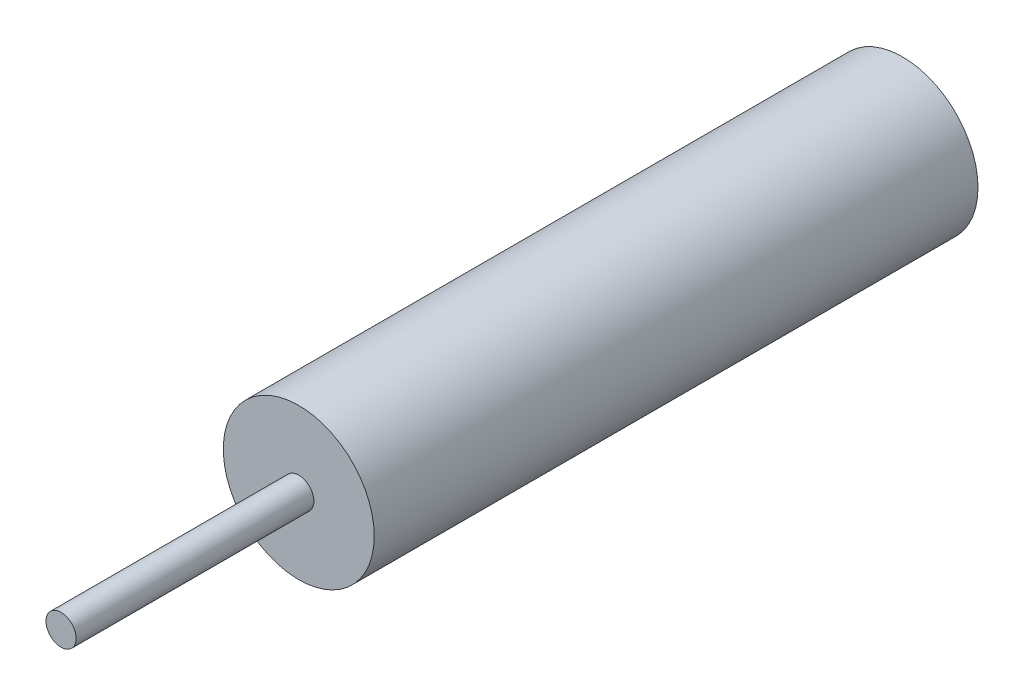
ISO-10303-21;
HEADER;
FILE_DESCRIPTION(('STEP AP214'),'2;1');
FILE_NAME('part.step','',(''),(''),'','','');
FILE_SCHEMA(('AUTOMOTIVE_DESIGN { 1 0 10303 214 1 1 1 1 }'));
ENDSEC;
DATA;
#1=APPLICATION_CONTEXT('core data for automotive mechanical design processes');
#2=APPLICATION_PROTOCOL_DEFINITION('international standard','automotive_design',2000,#1);
#3=PRODUCT_CONTEXT('',#1,'mechanical');
#4=PRODUCT('Part','Part','',(#3));
#5=PRODUCT_RELATED_PRODUCT_CATEGORY('part','',(#4));
#6=PRODUCT_DEFINITION_FORMATION('','',#4);
#7=PRODUCT_DEFINITION_CONTEXT('part definition',#1,'design');
#8=PRODUCT_DEFINITION('design','',#6,#7);
#9=PRODUCT_DEFINITION_SHAPE('','',#8);
#10=(LENGTH_UNIT() NAMED_UNIT(*) SI_UNIT(.MILLI.,.METRE.));
#11=(NAMED_UNIT(*) PLANE_ANGLE_UNIT() SI_UNIT($,.RADIAN.));
#12=(NAMED_UNIT(*) SI_UNIT($,.STERADIAN.) SOLID_ANGLE_UNIT());
#13=UNCERTAINTY_MEASURE_WITH_UNIT(LENGTH_MEASURE(1.E-05),#10,'distance_accuracy_value','');
#14=(GEOMETRIC_REPRESENTATION_CONTEXT(3) GLOBAL_UNCERTAINTY_ASSIGNED_CONTEXT((#13)) GLOBAL_UNIT_ASSIGNED_CONTEXT((#10,
#11,#12)) REPRESENTATION_CONTEXT('',''));
#15=CARTESIAN_POINT('',(0.,0.,0.));
#16=DIRECTION('',(0.,0.,1.));
#17=DIRECTION('',(1.,0.,0.));
#18=AXIS2_PLACEMENT_3D('',#15,#16,#17);
#19=CARTESIAN_POINT('',(0.,0.,25.4));
#20=DIRECTION('',(0.,0.,-1.));
#21=DIRECTION('',(-1.,0.,0.));
#22=AXIS2_PLACEMENT_3D('',#19,#20,#21);
#23=CYLINDRICAL_SURFACE('',#22,3.175);
#24=CARTESIAN_POINT('',(0.,0.,25.4));
#25=DIRECTION('',(0.,0.,1.));
#26=DIRECTION('',(1.,0.,0.));
#27=AXIS2_PLACEMENT_3D('',#24,#25,#26);
#28=CIRCLE('',#27,3.175);
#29=CARTESIAN_POINT('',(3.175,0.,25.4));
#30=VERTEX_POINT('',#29);
#31=EDGE_CURVE('E10',#30,#30,#28,.T.);
#32=ORIENTED_EDGE('',*,*,#31,.F.);
#33=EDGE_LOOP('',(#32));
#34=FACE_BOUND('',#33,.T.);
#35=CARTESIAN_POINT('',(0.,0.,0.));
#36=DIRECTION('',(0.,0.,1.));
#37=DIRECTION('',(1.,0.,0.));
#38=AXIS2_PLACEMENT_3D('',#35,#36,#37);
#39=CIRCLE('',#38,3.175);
#40=CARTESIAN_POINT('',(3.175,0.,0.));
#41=VERTEX_POINT('',#40);
#42=EDGE_CURVE('E34',#41,#41,#39,.T.);
#43=ORIENTED_EDGE('',*,*,#42,.T.);
#44=EDGE_LOOP('',(#43));
#45=FACE_BOUND('',#44,.T.);
#46=ADVANCED_FACE('F31',(#34,#45),#23,.T.);
#47=CARTESIAN_POINT('',(0.,0.,25.4));
#48=DIRECTION('',(0.,0.,1.));
#49=DIRECTION('',(1.,0.,0.));
#50=AXIS2_PLACEMENT_3D('',#47,#48,#49);
#51=PLANE('',#50);
#52=CARTESIAN_POINT('',(0.,0.,25.4));
#53=DIRECTION('',(0.,0.,1.));
#54=DIRECTION('',(1.,0.,0.));
#55=AXIS2_PLACEMENT_3D('',#52,#53,#54);
#56=CIRCLE('',#55,0.635);
#57=CARTESIAN_POINT('',(0.635,0.,25.4));
#58=VERTEX_POINT('',#57);
#59=EDGE_CURVE('E43',#58,#58,#56,.T.);
#60=ORIENTED_EDGE('',*,*,#59,.F.);
#61=EDGE_LOOP('',(#60));
#62=FACE_BOUND('',#61,.T.);
#63=ORIENTED_EDGE('',*,*,#31,.T.);
#64=EDGE_LOOP('',(#63));
#65=FACE_BOUND('',#64,.T.);
#66=ADVANCED_FACE('F58',(#62,#65),#51,.T.);
#67=CARTESIAN_POINT('',(0.,0.,0.));
#68=DIRECTION('',(0.,0.,1.));
#69=DIRECTION('',(1.,0.,0.));
#70=AXIS2_PLACEMENT_3D('',#67,#68,#69);
#71=PLANE('',#70);
#72=ORIENTED_EDGE('',*,*,#42,.F.);
#73=EDGE_LOOP('',(#72));
#74=FACE_BOUND('',#73,.T.);
#75=ADVANCED_FACE('F54',(#74),#71,.F.);
#76=CARTESIAN_POINT('',(0.,0.,35.4));
#77=DIRECTION('',(0.,0.,-1.));
#78=DIRECTION('',(-1.,0.,0.));
#79=AXIS2_PLACEMENT_3D('',#76,#77,#78);
#80=CYLINDRICAL_SURFACE('',#79,0.635);
#81=CARTESIAN_POINT('',(0.,0.,35.4));
#82=DIRECTION('',(0.,0.,1.));
#83=DIRECTION('',(1.,0.,0.));
#84=AXIS2_PLACEMENT_3D('',#81,#82,#83);
#85=CIRCLE('',#84,0.635);
#86=CARTESIAN_POINT('',(0.635,0.,35.4));
#87=VERTEX_POINT('',#86);
#88=EDGE_CURVE('E41',#87,#87,#85,.T.);
#89=ORIENTED_EDGE('',*,*,#88,.F.);
#90=EDGE_LOOP('',(#89));
#91=FACE_BOUND('',#90,.T.);
#92=ORIENTED_EDGE('',*,*,#59,.T.);
#93=EDGE_LOOP('',(#92));
#94=FACE_BOUND('',#93,.T.);
#95=ADVANCED_FACE('F51',(#91,#94),#80,.T.);
#96=CARTESIAN_POINT('',(0.,0.,35.4));
#97=DIRECTION('',(0.,0.,1.));
#98=DIRECTION('',(1.,0.,0.));
#99=AXIS2_PLACEMENT_3D('',#96,#97,#98);
#100=PLANE('',#99);
#101=ORIENTED_EDGE('',*,*,#88,.T.);
#102=EDGE_LOOP('',(#101));
#103=FACE_BOUND('',#102,.T.);
#104=ADVANCED_FACE('F49',(#103),#100,.T.);
#105=CLOSED_SHELL('',(#46,#66,#75,#95,#104));
#106=MANIFOLD_SOLID_BREP('B2',#105);
#107=ADVANCED_BREP_SHAPE_REPRESENTATION('',(#18,#106),#14);
#108=SHAPE_DEFINITION_REPRESENTATION(#9,#107);
ENDSEC;
END-ISO-10303-21;
